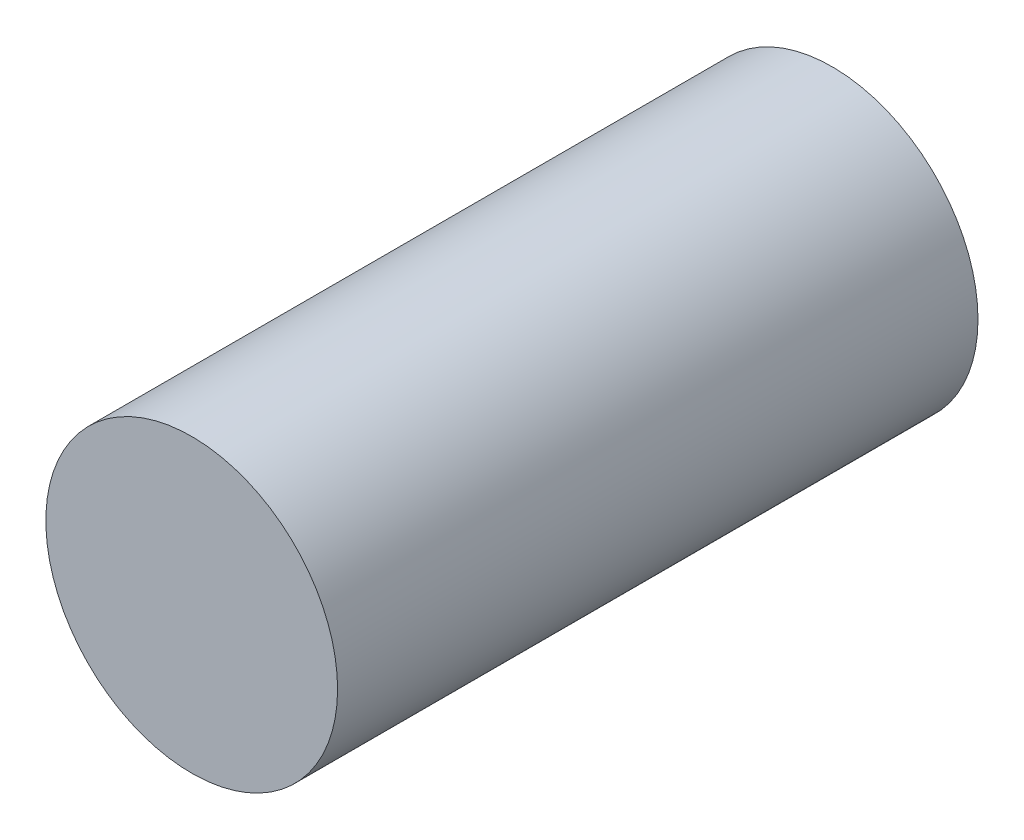
ISO-10303-21;
HEADER;
FILE_DESCRIPTION(('STEP AP214'),'2;1');
FILE_NAME('part.step','',(''),(''),'','','');
FILE_SCHEMA(('AUTOMOTIVE_DESIGN { 1 0 10303 214 1 1 1 1 }'));
ENDSEC;
DATA;
#1=APPLICATION_CONTEXT('core data for automotive mechanical design processes');
#2=APPLICATION_PROTOCOL_DEFINITION('international standard','automotive_design',2000,#1);
#3=PRODUCT_CONTEXT('',#1,'mechanical');
#4=PRODUCT('Part','Part','',(#3));
#5=PRODUCT_RELATED_PRODUCT_CATEGORY('part','',(#4));
#6=PRODUCT_DEFINITION_FORMATION('','',#4);
#7=PRODUCT_DEFINITION_CONTEXT('part definition',#1,'design');
#8=PRODUCT_DEFINITION('design','',#6,#7);
#9=PRODUCT_DEFINITION_SHAPE('','',#8);
#10=(LENGTH_UNIT() NAMED_UNIT(*) SI_UNIT(.MILLI.,.METRE.));
#11=(NAMED_UNIT(*) PLANE_ANGLE_UNIT() SI_UNIT($,.RADIAN.));
#12=(NAMED_UNIT(*) SI_UNIT($,.STERADIAN.) SOLID_ANGLE_UNIT());
#13=UNCERTAINTY_MEASURE_WITH_UNIT(LENGTH_MEASURE(1.E-05),#10,'distance_accuracy_value','');
#14=(GEOMETRIC_REPRESENTATION_CONTEXT(3) GLOBAL_UNCERTAINTY_ASSIGNED_CONTEXT((#13)) GLOBAL_UNIT_ASSIGNED_CONTEXT((#10,
#11,#12)) REPRESENTATION_CONTEXT('',''));
#15=CARTESIAN_POINT('',(0.,0.,0.));
#16=DIRECTION('',(0.,0.,1.));
#17=DIRECTION('',(1.,0.,0.));
#18=AXIS2_PLACEMENT_3D('',#15,#16,#17);
#19=CARTESIAN_POINT('',(-2.54,1.27,0.1));
#20=DIRECTION('',(0.,0.,1.));
#21=DIRECTION('',(1.,0.,0.));
#22=AXIS2_PLACEMENT_3D('',#19,#20,#21);
#23=PLANE('',#22);
#24=CARTESIAN_POINT('',(-2.54,1.27,0.1));
#25=DIRECTION('',(0.,0.,1.));
#26=DIRECTION('',(1.,0.,0.));
#27=AXIS2_PLACEMENT_3D('',#24,#25,#26);
#28=CIRCLE('',#27,0.41);
#29=CARTESIAN_POINT('',(-2.13,1.27,0.1));
#30=VERTEX_POINT('',#29);
#31=EDGE_CURVE('E17',#30,#30,#28,.F.);
#32=ORIENTED_EDGE('',*,*,#31,.F.);
#33=EDGE_LOOP('',(#32));
#34=FACE_BOUND('',#33,.T.);
#35=ADVANCED_FACE('F14',(#34),#23,.T.);
#36=CARTESIAN_POINT('',(-2.54,1.27,-1.7));
#37=DIRECTION('',(0.,0.,1.));
#38=DIRECTION('',(1.,0.,0.));
#39=AXIS2_PLACEMENT_3D('',#36,#37,#38);
#40=PLANE('',#39);
#41=CARTESIAN_POINT('',(-2.54,1.27,-1.7));
#42=DIRECTION('',(0.,0.,1.));
#43=DIRECTION('',(1.,0.,0.));
#44=AXIS2_PLACEMENT_3D('',#41,#42,#43);
#45=CIRCLE('',#44,0.41);
#46=CARTESIAN_POINT('',(-2.13,1.27,-1.7));
#47=VERTEX_POINT('',#46);
#48=EDGE_CURVE('E10',#47,#47,#45,.T.);
#49=ORIENTED_EDGE('',*,*,#48,.F.);
#50=EDGE_LOOP('',(#49));
#51=FACE_BOUND('',#50,.T.);
#52=ADVANCED_FACE('F29',(#51),#40,.F.);
#53=CARTESIAN_POINT('',(-2.54,1.27,-1.7));
#54=DIRECTION('',(0.,0.,1.));
#55=DIRECTION('',(1.,0.,0.));
#56=AXIS2_PLACEMENT_3D('',#53,#54,#55);
#57=CYLINDRICAL_SURFACE('',#56,0.41);
#58=ORIENTED_EDGE('',*,*,#48,.T.);
#59=EDGE_LOOP('',(#58));
#60=FACE_BOUND('',#59,.T.);
#61=ORIENTED_EDGE('',*,*,#31,.T.);
#62=EDGE_LOOP('',(#61));
#63=FACE_BOUND('',#62,.T.);
#64=ADVANCED_FACE('F26',(#60,#63),#57,.T.);
#65=CLOSED_SHELL('',(#35,#52,#64));
#66=MANIFOLD_SOLID_BREP('B1',#65);
#67=ADVANCED_BREP_SHAPE_REPRESENTATION('',(#18,#66),#14);
#68=SHAPE_DEFINITION_REPRESENTATION(#9,#67);
ENDSEC;
END-ISO-10303-21;
